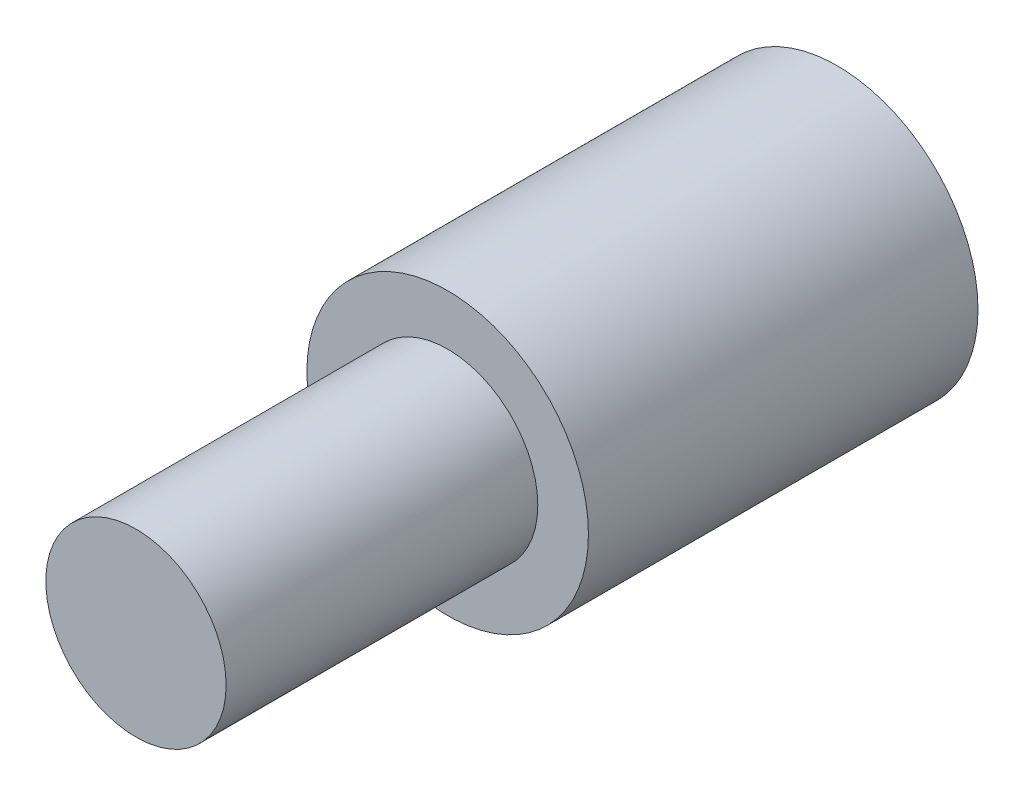
ISO-10303-21;
HEADER;
FILE_DESCRIPTION(('STEP AP214'),'2;1');
FILE_NAME('part.step','',(''),(''),'','','');
FILE_SCHEMA(('AUTOMOTIVE_DESIGN { 1 0 10303 214 1 1 1 1 }'));
ENDSEC;
DATA;
#1=APPLICATION_CONTEXT('core data for automotive mechanical design processes');
#2=APPLICATION_PROTOCOL_DEFINITION('international standard','automotive_design',2000,#1);
#3=PRODUCT_CONTEXT('',#1,'mechanical');
#4=PRODUCT('Part','Part','',(#3));
#5=PRODUCT_RELATED_PRODUCT_CATEGORY('part','',(#4));
#6=PRODUCT_DEFINITION_FORMATION('','',#4);
#7=PRODUCT_DEFINITION_CONTEXT('part definition',#1,'design');
#8=PRODUCT_DEFINITION('design','',#6,#7);
#9=PRODUCT_DEFINITION_SHAPE('','',#8);
#10=(LENGTH_UNIT() NAMED_UNIT(*) SI_UNIT(.MILLI.,.METRE.));
#11=(NAMED_UNIT(*) PLANE_ANGLE_UNIT() SI_UNIT($,.RADIAN.));
#12=(NAMED_UNIT(*) SI_UNIT($,.STERADIAN.) SOLID_ANGLE_UNIT());
#13=UNCERTAINTY_MEASURE_WITH_UNIT(LENGTH_MEASURE(1.E-05),#10,'distance_accuracy_value','');
#14=(GEOMETRIC_REPRESENTATION_CONTEXT(3) GLOBAL_UNCERTAINTY_ASSIGNED_CONTEXT((#13)) GLOBAL_UNIT_ASSIGNED_CONTEXT((#10,
#11,#12)) REPRESENTATION_CONTEXT('',''));
#15=CARTESIAN_POINT('',(0.,0.,0.));
#16=DIRECTION('',(0.,0.,1.));
#17=DIRECTION('',(1.,0.,0.));
#18=AXIS2_PLACEMENT_3D('',#15,#16,#17);
#19=CARTESIAN_POINT('',(-23.3472795370631,22.5825022919253,60.));
#20=DIRECTION('',(0.,0.,-1.));
#21=DIRECTION('',(-1.,0.,0.));
#22=AXIS2_PLACEMENT_3D('',#19,#20,#21);
#23=CYLINDRICAL_SURFACE('',#22,21.6800230123014);
#24=CARTESIAN_POINT('',(-23.3472795370631,22.5825022919253,60.));
#25=DIRECTION('',(0.,0.,1.));
#26=DIRECTION('',(1.,0.,0.));
#27=AXIS2_PLACEMENT_3D('',#24,#25,#26);
#28=CIRCLE('',#27,21.6800230123014);
#29=CARTESIAN_POINT('',(-1.66725652476163,22.5825022919253,60.));
#30=VERTEX_POINT('',#29);
#31=EDGE_CURVE('E10',#30,#30,#28,.T.);
#32=ORIENTED_EDGE('',*,*,#31,.F.);
#33=EDGE_LOOP('',(#32));
#34=FACE_BOUND('',#33,.T.);
#35=CARTESIAN_POINT('',(-23.3472795370631,22.5825022919253,0.));
#36=DIRECTION('',(0.,0.,1.));
#37=DIRECTION('',(1.,0.,0.));
#38=AXIS2_PLACEMENT_3D('',#35,#36,#37);
#39=CIRCLE('',#38,21.6800230123014);
#40=CARTESIAN_POINT('',(-1.66725652476163,22.5825022919253,0.));
#41=VERTEX_POINT('',#40);
#42=EDGE_CURVE('E34',#41,#41,#39,.T.);
#43=ORIENTED_EDGE('',*,*,#42,.T.);
#44=EDGE_LOOP('',(#43));
#45=FACE_BOUND('',#44,.T.);
#46=ADVANCED_FACE('F31',(#34,#45),#23,.T.);
#47=CARTESIAN_POINT('',(-23.3472795370631,22.5825022919253,60.));
#48=DIRECTION('',(0.,0.,1.));
#49=DIRECTION('',(1.,0.,0.));
#50=AXIS2_PLACEMENT_3D('',#47,#48,#49);
#51=PLANE('',#50);
#52=CARTESIAN_POINT('',(-23.3472795370631,22.5825022919253,60.));
#53=DIRECTION('',(0.,0.,1.));
#54=DIRECTION('',(1.,0.,0.));
#55=AXIS2_PLACEMENT_3D('',#52,#53,#54);
#56=CIRCLE('',#55,13.8828223100305);
#57=CARTESIAN_POINT('',(-9.46445722703256,22.5825022919253,60.));
#58=VERTEX_POINT('',#57);
#59=EDGE_CURVE('E41',#58,#58,#56,.F.);
#60=ORIENTED_EDGE('',*,*,#59,.T.);
#61=EDGE_LOOP('',(#60));
#62=FACE_BOUND('',#61,.T.);
#63=ORIENTED_EDGE('',*,*,#31,.T.);
#64=EDGE_LOOP('',(#63));
#65=FACE_BOUND('',#64,.T.);
#66=ADVANCED_FACE('F61',(#62,#65),#51,.T.);
#67=CARTESIAN_POINT('',(-23.3472795370631,22.5825022919253,0.));
#68=DIRECTION('',(0.,0.,1.));
#69=DIRECTION('',(1.,0.,0.));
#70=AXIS2_PLACEMENT_3D('',#67,#68,#69);
#71=PLANE('',#70);
#72=ORIENTED_EDGE('',*,*,#42,.F.);
#73=EDGE_LOOP('',(#72));
#74=FACE_BOUND('',#73,.T.);
#75=ADVANCED_FACE('F53',(#74),#71,.F.);
#76=CARTESIAN_POINT('',(-23.3472795370631,22.5825022919253,108.));
#77=DIRECTION('',(0.,0.,-1.));
#78=DIRECTION('',(-1.,0.,0.));
#79=AXIS2_PLACEMENT_3D('',#76,#77,#78);
#80=CYLINDRICAL_SURFACE('',#79,13.8828223100305);
#81=ORIENTED_EDGE('',*,*,#59,.F.);
#82=EDGE_LOOP('',(#81));
#83=FACE_BOUND('',#82,.T.);
#84=CARTESIAN_POINT('',(-23.3472795370631,22.5825022919253,108.));
#85=DIRECTION('',(0.,0.,1.));
#86=DIRECTION('',(1.,0.,0.));
#87=AXIS2_PLACEMENT_3D('',#84,#85,#86);
#88=CIRCLE('',#87,13.8828223100305);
#89=CARTESIAN_POINT('',(-9.46445722703256,22.5825022919253,108.));
#90=VERTEX_POINT('',#89);
#91=EDGE_CURVE('E45',#90,#90,#88,.T.);
#92=ORIENTED_EDGE('',*,*,#91,.F.);
#93=EDGE_LOOP('',(#92));
#94=FACE_BOUND('',#93,.T.);
#95=ADVANCED_FACE('F51',(#83,#94),#80,.T.);
#96=CARTESIAN_POINT('',(-23.3472795370631,22.5825022919253,108.));
#97=DIRECTION('',(0.,0.,1.));
#98=DIRECTION('',(1.,0.,0.));
#99=AXIS2_PLACEMENT_3D('',#96,#97,#98);
#100=PLANE('',#99);
#101=ORIENTED_EDGE('',*,*,#91,.T.);
#102=EDGE_LOOP('',(#101));
#103=FACE_BOUND('',#102,.T.);
#104=ADVANCED_FACE('F49',(#103),#100,.T.);
#105=CLOSED_SHELL('',(#46,#66,#75,#95,#104));
#106=MANIFOLD_SOLID_BREP('B2',#105);
#107=ADVANCED_BREP_SHAPE_REPRESENTATION('',(#18,#106),#14);
#108=SHAPE_DEFINITION_REPRESENTATION(#9,#107);
ENDSEC;
END-ISO-10303-21;
